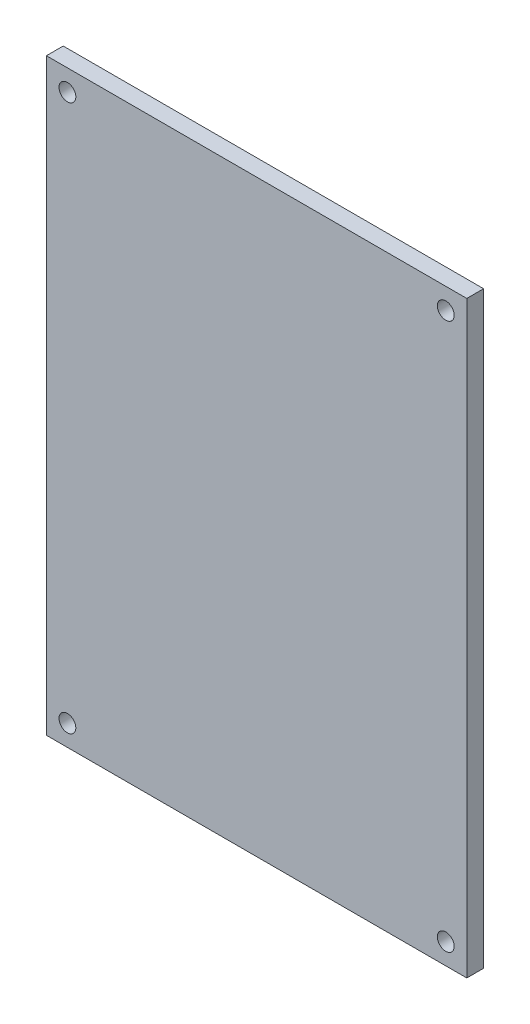
ISO-10303-21;
HEADER;
FILE_DESCRIPTION(('STEP AP214'),'2;1');
FILE_NAME('part.step','',(''),(''),'','','');
FILE_SCHEMA(('AUTOMOTIVE_DESIGN { 1 0 10303 214 1 1 1 1 }'));
ENDSEC;
DATA;
#1=APPLICATION_CONTEXT('core data for automotive mechanical design processes');
#2=APPLICATION_PROTOCOL_DEFINITION('international standard','automotive_design',2000,#1);
#3=PRODUCT_CONTEXT('',#1,'mechanical');
#4=PRODUCT('Part','Part','',(#3));
#5=PRODUCT_RELATED_PRODUCT_CATEGORY('part','',(#4));
#6=PRODUCT_DEFINITION_FORMATION('','',#4);
#7=PRODUCT_DEFINITION_CONTEXT('part definition',#1,'design');
#8=PRODUCT_DEFINITION('design','',#6,#7);
#9=PRODUCT_DEFINITION_SHAPE('','',#8);
#10=(LENGTH_UNIT() NAMED_UNIT(*) SI_UNIT(.MILLI.,.METRE.));
#11=(NAMED_UNIT(*) PLANE_ANGLE_UNIT() SI_UNIT($,.RADIAN.));
#12=(NAMED_UNIT(*) SI_UNIT($,.STERADIAN.) SOLID_ANGLE_UNIT());
#13=UNCERTAINTY_MEASURE_WITH_UNIT(LENGTH_MEASURE(1.E-05),#10,'distance_accuracy_value','');
#14=(GEOMETRIC_REPRESENTATION_CONTEXT(3) GLOBAL_UNCERTAINTY_ASSIGNED_CONTEXT((#13)) GLOBAL_UNIT_ASSIGNED_CONTEXT((#10,
#11,#12)) REPRESENTATION_CONTEXT('',''));
#15=CARTESIAN_POINT('',(0.,0.,0.));
#16=DIRECTION('',(0.,0.,1.));
#17=DIRECTION('',(1.,0.,0.));
#18=AXIS2_PLACEMENT_3D('',#15,#16,#17);
#19=CARTESIAN_POINT('',(0.,0.,2.));
#20=DIRECTION('',(0.,0.,1.));
#21=DIRECTION('',(1.,0.,0.));
#22=AXIS2_PLACEMENT_3D('',#19,#20,#21);
#23=PLANE('',#22);
#24=CARTESIAN_POINT('',(22.5,-32.5,2.));
#25=DIRECTION('',(0.,0.,1.));
#26=DIRECTION('',(1.,0.,0.));
#27=AXIS2_PLACEMENT_3D('',#24,#25,#26);
#28=CIRCLE('',#27,1.);
#29=CARTESIAN_POINT('',(23.5,-32.5,2.));
#30=VERTEX_POINT('',#29);
#31=EDGE_CURVE('E122',#30,#30,#28,.T.);
#32=ORIENTED_EDGE('',*,*,#31,.F.);
#33=EDGE_LOOP('',(#32));
#34=FACE_BOUND('',#33,.T.);
#35=CARTESIAN_POINT('',(-22.5,32.5,2.));
#36=DIRECTION('',(0.,0.,1.));
#37=DIRECTION('',(1.,0.,0.));
#38=AXIS2_PLACEMENT_3D('',#35,#36,#37);
#39=CIRCLE('',#38,1.);
#40=CARTESIAN_POINT('',(-21.5,32.5,2.));
#41=VERTEX_POINT('',#40);
#42=EDGE_CURVE('E101',#41,#41,#39,.T.);
#43=ORIENTED_EDGE('',*,*,#42,.F.);
#44=EDGE_LOOP('',(#43));
#45=FACE_BOUND('',#44,.T.);
#46=DIRECTION('',(0.,1.,0.));
#47=VECTOR('',#46,1.);
#48=CARTESIAN_POINT('',(25.,35.,2.));
#49=LINE('',#48,#47);
#50=CARTESIAN_POINT('',(25.,-35.,2.));
#51=VERTEX_POINT('',#50);
#52=CARTESIAN_POINT('',(25.,35.,2.));
#53=VERTEX_POINT('',#52);
#54=EDGE_CURVE('E86',#51,#53,#49,.T.);
#55=ORIENTED_EDGE('',*,*,#54,.T.);
#56=DIRECTION('',(-1.,0.,0.));
#57=VECTOR('',#56,1.);
#58=CARTESIAN_POINT('',(-25.,35.,2.));
#59=LINE('',#58,#57);
#60=CARTESIAN_POINT('',(-25.,35.,2.));
#61=VERTEX_POINT('',#60);
#62=EDGE_CURVE('E81',#53,#61,#59,.T.);
#63=ORIENTED_EDGE('',*,*,#62,.T.);
#64=DIRECTION('',(0.,-1.,0.));
#65=VECTOR('',#64,1.);
#66=CARTESIAN_POINT('',(-25.,35.,2.));
#67=LINE('',#66,#65);
#68=CARTESIAN_POINT('',(-25.,-35.,2.));
#69=VERTEX_POINT('',#68);
#70=EDGE_CURVE('E84',#61,#69,#67,.T.);
#71=ORIENTED_EDGE('',*,*,#70,.T.);
#72=DIRECTION('',(1.,0.,0.));
#73=VECTOR('',#72,1.);
#74=CARTESIAN_POINT('',(-25.,-35.,2.));
#75=LINE('',#74,#73);
#76=EDGE_CURVE('E51',#69,#51,#75,.T.);
#77=ORIENTED_EDGE('',*,*,#76,.T.);
#78=EDGE_LOOP('',(#55,#63,#71,#77));
#79=FACE_BOUND('',#78,.T.);
#80=CARTESIAN_POINT('',(22.5,32.5,2.));
#81=DIRECTION('',(0.,0.,1.));
#82=DIRECTION('',(-1.,0.,0.));
#83=AXIS2_PLACEMENT_3D('',#80,#81,#82);
#84=CIRCLE('',#83,1.);
#85=CARTESIAN_POINT('',(21.5,32.5,2.));
#86=VERTEX_POINT('',#85);
#87=EDGE_CURVE('E116',#86,#86,#84,.T.);
#88=ORIENTED_EDGE('',*,*,#87,.F.);
#89=EDGE_LOOP('',(#88));
#90=FACE_BOUND('',#89,.T.);
#91=CARTESIAN_POINT('',(-22.5,-32.5,2.));
#92=DIRECTION('',(0.,0.,1.));
#93=DIRECTION('',(-1.,0.,0.));
#94=AXIS2_PLACEMENT_3D('',#91,#92,#93);
#95=CIRCLE('',#94,1.);
#96=CARTESIAN_POINT('',(-23.5,-32.5,2.));
#97=VERTEX_POINT('',#96);
#98=EDGE_CURVE('E128',#97,#97,#95,.T.);
#99=ORIENTED_EDGE('',*,*,#98,.F.);
#100=EDGE_LOOP('',(#99));
#101=FACE_BOUND('',#100,.T.);
#102=ADVANCED_FACE('F34',(#34,#45,#79,#90,#101),#23,.T.);
#103=CARTESIAN_POINT('',(0.,0.,0.));
#104=DIRECTION('',(0.,0.,1.));
#105=DIRECTION('',(1.,0.,0.));
#106=AXIS2_PLACEMENT_3D('',#103,#104,#105);
#107=PLANE('',#106);
#108=DIRECTION('',(0.,1.,0.));
#109=VECTOR('',#108,1.);
#110=CARTESIAN_POINT('',(25.,35.,0.));
#111=LINE('',#110,#109);
#112=CARTESIAN_POINT('',(25.,-35.,0.));
#113=VERTEX_POINT('',#112);
#114=CARTESIAN_POINT('',(25.,35.,0.));
#115=VERTEX_POINT('',#114);
#116=EDGE_CURVE('E98',#113,#115,#111,.T.);
#117=ORIENTED_EDGE('',*,*,#116,.F.);
#118=DIRECTION('',(1.,0.,0.));
#119=VECTOR('',#118,1.);
#120=CARTESIAN_POINT('',(-25.,-35.,0.));
#121=LINE('',#120,#119);
#122=CARTESIAN_POINT('',(-25.,-35.,0.));
#123=VERTEX_POINT('',#122);
#124=EDGE_CURVE('E74',#123,#113,#121,.T.);
#125=ORIENTED_EDGE('',*,*,#124,.F.);
#126=DIRECTION('',(0.,-1.,0.));
#127=VECTOR('',#126,1.);
#128=CARTESIAN_POINT('',(-25.,35.,0.));
#129=LINE('',#128,#127);
#130=CARTESIAN_POINT('',(-25.,35.,0.));
#131=VERTEX_POINT('',#130);
#132=EDGE_CURVE('E68',#131,#123,#129,.T.);
#133=ORIENTED_EDGE('',*,*,#132,.F.);
#134=DIRECTION('',(-1.,0.,0.));
#135=VECTOR('',#134,1.);
#136=CARTESIAN_POINT('',(-25.,35.,0.));
#137=LINE('',#136,#135);
#138=EDGE_CURVE('E90',#115,#131,#137,.T.);
#139=ORIENTED_EDGE('',*,*,#138,.F.);
#140=EDGE_LOOP('',(#117,#125,#133,#139));
#141=FACE_BOUND('',#140,.T.);
#142=CARTESIAN_POINT('',(-22.5,32.5,0.));
#143=DIRECTION('',(0.,0.,1.));
#144=DIRECTION('',(1.,0.,0.));
#145=AXIS2_PLACEMENT_3D('',#142,#143,#144);
#146=CIRCLE('',#145,1.);
#147=CARTESIAN_POINT('',(-21.5,32.5,0.));
#148=VERTEX_POINT('',#147);
#149=EDGE_CURVE('E113',#148,#148,#146,.T.);
#150=ORIENTED_EDGE('',*,*,#149,.T.);
#151=EDGE_LOOP('',(#150));
#152=FACE_BOUND('',#151,.T.);
#153=CARTESIAN_POINT('',(22.5,32.5,0.));
#154=DIRECTION('',(0.,0.,1.));
#155=DIRECTION('',(-1.,0.,0.));
#156=AXIS2_PLACEMENT_3D('',#153,#154,#155);
#157=CIRCLE('',#156,1.);
#158=CARTESIAN_POINT('',(21.5,32.5,0.));
#159=VERTEX_POINT('',#158);
#160=EDGE_CURVE('E119',#159,#159,#157,.T.);
#161=ORIENTED_EDGE('',*,*,#160,.T.);
#162=EDGE_LOOP('',(#161));
#163=FACE_BOUND('',#162,.T.);
#164=CARTESIAN_POINT('',(22.5,-32.5,0.));
#165=DIRECTION('',(0.,0.,1.));
#166=DIRECTION('',(1.,0.,0.));
#167=AXIS2_PLACEMENT_3D('',#164,#165,#166);
#168=CIRCLE('',#167,1.);
#169=CARTESIAN_POINT('',(23.5,-32.5,0.));
#170=VERTEX_POINT('',#169);
#171=EDGE_CURVE('E125',#170,#170,#168,.T.);
#172=ORIENTED_EDGE('',*,*,#171,.T.);
#173=EDGE_LOOP('',(#172));
#174=FACE_BOUND('',#173,.T.);
#175=CARTESIAN_POINT('',(-22.5,-32.5,0.));
#176=DIRECTION('',(0.,0.,1.));
#177=DIRECTION('',(-1.,0.,0.));
#178=AXIS2_PLACEMENT_3D('',#175,#176,#177);
#179=CIRCLE('',#178,1.);
#180=CARTESIAN_POINT('',(-23.5,-32.5,0.));
#181=VERTEX_POINT('',#180);
#182=EDGE_CURVE('E131',#181,#181,#179,.T.);
#183=ORIENTED_EDGE('',*,*,#182,.T.);
#184=EDGE_LOOP('',(#183));
#185=FACE_BOUND('',#184,.T.);
#186=ADVANCED_FACE('F109',(#141,#152,#163,#174,#185),#107,.F.);
#187=CARTESIAN_POINT('',(25.,35.,2.));
#188=DIRECTION('',(-1.,0.,0.));
#189=DIRECTION('',(0.,-1.,0.));
#190=AXIS2_PLACEMENT_3D('',#187,#188,#189);
#191=PLANE('',#190);
#192=ORIENTED_EDGE('',*,*,#116,.T.);
#193=DIRECTION('',(0.,0.,-1.));
#194=VECTOR('',#193,1.);
#195=CARTESIAN_POINT('',(25.,35.,2.));
#196=LINE('',#195,#194);
#197=EDGE_CURVE('E11',#53,#115,#196,.T.);
#198=ORIENTED_EDGE('',*,*,#197,.F.);
#199=ORIENTED_EDGE('',*,*,#54,.F.);
#200=DIRECTION('',(0.,0.,-1.));
#201=VECTOR('',#200,1.);
#202=CARTESIAN_POINT('',(25.,-35.,2.));
#203=LINE('',#202,#201);
#204=EDGE_CURVE('E94',#51,#113,#203,.T.);
#205=ORIENTED_EDGE('',*,*,#204,.T.);
#206=EDGE_LOOP('',(#192,#198,#199,#205));
#207=FACE_BOUND('',#206,.T.);
#208=ADVANCED_FACE('F36',(#207),#191,.F.);
#209=CARTESIAN_POINT('',(-25.,35.,2.));
#210=DIRECTION('',(0.,-1.,0.));
#211=DIRECTION('',(1.,0.,0.));
#212=AXIS2_PLACEMENT_3D('',#209,#210,#211);
#213=PLANE('',#212);
#214=ORIENTED_EDGE('',*,*,#138,.T.);
#215=DIRECTION('',(0.,0.,-1.));
#216=VECTOR('',#215,1.);
#217=CARTESIAN_POINT('',(-25.,35.,2.));
#218=LINE('',#217,#216);
#219=EDGE_CURVE('E43',#61,#131,#218,.T.);
#220=ORIENTED_EDGE('',*,*,#219,.F.);
#221=ORIENTED_EDGE('',*,*,#62,.F.);
#222=ORIENTED_EDGE('',*,*,#197,.T.);
#223=EDGE_LOOP('',(#214,#220,#221,#222));
#224=FACE_BOUND('',#223,.T.);
#225=ADVANCED_FACE('F89',(#224),#213,.F.);
#226=CARTESIAN_POINT('',(-25.,35.,2.));
#227=DIRECTION('',(1.,0.,0.));
#228=DIRECTION('',(0.,1.,0.));
#229=AXIS2_PLACEMENT_3D('',#226,#227,#228);
#230=PLANE('',#229);
#231=ORIENTED_EDGE('',*,*,#132,.T.);
#232=DIRECTION('',(0.,0.,-1.));
#233=VECTOR('',#232,1.);
#234=CARTESIAN_POINT('',(-25.,-35.,2.));
#235=LINE('',#234,#233);
#236=EDGE_CURVE('E91',#69,#123,#235,.T.);
#237=ORIENTED_EDGE('',*,*,#236,.F.);
#238=ORIENTED_EDGE('',*,*,#70,.F.);
#239=ORIENTED_EDGE('',*,*,#219,.T.);
#240=EDGE_LOOP('',(#231,#237,#238,#239));
#241=FACE_BOUND('',#240,.T.);
#242=ADVANCED_FACE('F92',(#241),#230,.F.);
#243=CARTESIAN_POINT('',(-25.,-35.,2.));
#244=DIRECTION('',(0.,1.,0.));
#245=DIRECTION('',(0.,0.,1.));
#246=AXIS2_PLACEMENT_3D('',#243,#244,#245);
#247=PLANE('',#246);
#248=ORIENTED_EDGE('',*,*,#124,.T.);
#249=ORIENTED_EDGE('',*,*,#204,.F.);
#250=ORIENTED_EDGE('',*,*,#76,.F.);
#251=ORIENTED_EDGE('',*,*,#236,.T.);
#252=EDGE_LOOP('',(#248,#249,#250,#251));
#253=FACE_BOUND('',#252,.T.);
#254=ADVANCED_FACE('F106',(#253),#247,.F.);
#255=CARTESIAN_POINT('',(-22.5,32.5,2.));
#256=DIRECTION('',(0.,0.,-1.));
#257=DIRECTION('',(-1.,0.,0.));
#258=AXIS2_PLACEMENT_3D('',#255,#256,#257);
#259=CYLINDRICAL_SURFACE('',#258,1.);
#260=ORIENTED_EDGE('',*,*,#42,.T.);
#261=EDGE_LOOP('',(#260));
#262=FACE_BOUND('',#261,.T.);
#263=ORIENTED_EDGE('',*,*,#149,.F.);
#264=EDGE_LOOP('',(#263));
#265=FACE_BOUND('',#264,.T.);
#266=ADVANCED_FACE('F150',(#262,#265),#259,.F.);
#267=CARTESIAN_POINT('',(22.5,32.5,2.));
#268=DIRECTION('',(0.,0.,-1.));
#269=DIRECTION('',(-1.,0.,0.));
#270=AXIS2_PLACEMENT_3D('',#267,#268,#269);
#271=CYLINDRICAL_SURFACE('',#270,1.);
#272=ORIENTED_EDGE('',*,*,#87,.T.);
#273=EDGE_LOOP('',(#272));
#274=FACE_BOUND('',#273,.T.);
#275=ORIENTED_EDGE('',*,*,#160,.F.);
#276=EDGE_LOOP('',(#275));
#277=FACE_BOUND('',#276,.T.);
#278=ADVANCED_FACE('F196',(#274,#277),#271,.F.);
#279=CARTESIAN_POINT('',(22.5,-32.5,2.));
#280=DIRECTION('',(0.,0.,-1.));
#281=DIRECTION('',(-1.,0.,0.));
#282=AXIS2_PLACEMENT_3D('',#279,#280,#281);
#283=CYLINDRICAL_SURFACE('',#282,1.);
#284=ORIENTED_EDGE('',*,*,#31,.T.);
#285=EDGE_LOOP('',(#284));
#286=FACE_BOUND('',#285,.T.);
#287=ORIENTED_EDGE('',*,*,#171,.F.);
#288=EDGE_LOOP('',(#287));
#289=FACE_BOUND('',#288,.T.);
#290=ADVANCED_FACE('F204',(#286,#289),#283,.F.);
#291=CARTESIAN_POINT('',(-22.5,-32.5,2.));
#292=DIRECTION('',(0.,0.,-1.));
#293=DIRECTION('',(-1.,0.,0.));
#294=AXIS2_PLACEMENT_3D('',#291,#292,#293);
#295=CYLINDRICAL_SURFACE('',#294,1.);
#296=ORIENTED_EDGE('',*,*,#98,.T.);
#297=EDGE_LOOP('',(#296));
#298=FACE_BOUND('',#297,.T.);
#299=ORIENTED_EDGE('',*,*,#182,.F.);
#300=EDGE_LOOP('',(#299));
#301=FACE_BOUND('',#300,.T.);
#302=ADVANCED_FACE('F137',(#298,#301),#295,.F.);
#303=CLOSED_SHELL('',(#102,#186,#208,#225,#242,#254,#266,#278,#290,#302));
#304=MANIFOLD_SOLID_BREP('B2',#303);
#305=ADVANCED_BREP_SHAPE_REPRESENTATION('',(#18,#304),#14);
#306=SHAPE_DEFINITION_REPRESENTATION(#9,#305);
ENDSEC;
END-ISO-10303-21;
